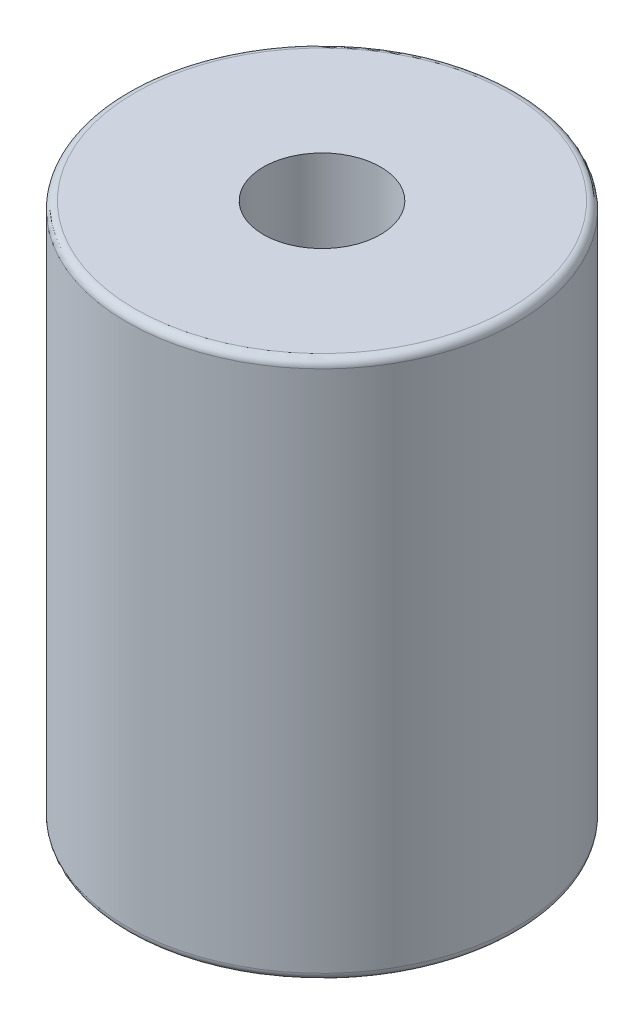
ISO-10303-21;
HEADER;
FILE_DESCRIPTION(('STEP AP214'),'2;1');
FILE_NAME('part.step','',(''),(''),'','','');
FILE_SCHEMA(('AUTOMOTIVE_DESIGN { 1 0 10303 214 1 1 1 1 }'));
ENDSEC;
DATA;
#1=APPLICATION_CONTEXT('core data for automotive mechanical design processes');
#2=APPLICATION_PROTOCOL_DEFINITION('international standard','automotive_design',2000,#1);
#3=PRODUCT_CONTEXT('',#1,'mechanical');
#4=PRODUCT('Part','Part','',(#3));
#5=PRODUCT_RELATED_PRODUCT_CATEGORY('part','',(#4));
#6=PRODUCT_DEFINITION_FORMATION('','',#4);
#7=PRODUCT_DEFINITION_CONTEXT('part definition',#1,'design');
#8=PRODUCT_DEFINITION('design','',#6,#7);
#9=PRODUCT_DEFINITION_SHAPE('','',#8);
#10=(LENGTH_UNIT() NAMED_UNIT(*) SI_UNIT(.MILLI.,.METRE.));
#11=(NAMED_UNIT(*) PLANE_ANGLE_UNIT() SI_UNIT($,.RADIAN.));
#12=(NAMED_UNIT(*) SI_UNIT($,.STERADIAN.) SOLID_ANGLE_UNIT());
#13=UNCERTAINTY_MEASURE_WITH_UNIT(LENGTH_MEASURE(1.E-05),#10,'distance_accuracy_value','');
#14=(GEOMETRIC_REPRESENTATION_CONTEXT(3) GLOBAL_UNCERTAINTY_ASSIGNED_CONTEXT((#13)) GLOBAL_UNIT_ASSIGNED_CONTEXT((#10,
#11,#12)) REPRESENTATION_CONTEXT('',''));
#15=CARTESIAN_POINT('',(0.,0.,0.));
#16=DIRECTION('',(0.,0.,1.));
#17=DIRECTION('',(1.,0.,0.));
#18=AXIS2_PLACEMENT_3D('',#15,#16,#17);
#19=CARTESIAN_POINT('',(0.,6.9,0.));
#20=DIRECTION('',(0.,-1.,0.));
#21=DIRECTION('',(0.,0.,-1.));
#22=AXIS2_PLACEMENT_3D('',#19,#20,#21);
#23=CYLINDRICAL_SURFACE('',#22,2.495);
#24=CARTESIAN_POINT('',(0.,0.1,0.));
#25=DIRECTION('',(0.,1.,0.));
#26=DIRECTION('',(0.,0.,1.));
#27=AXIS2_PLACEMENT_3D('',#24,#25,#26);
#28=CIRCLE('',#27,2.495);
#29=CARTESIAN_POINT('',(0.,0.1,2.495));
#30=VERTEX_POINT('',#29);
#31=EDGE_CURVE('E45',#30,#30,#28,.T.);
#32=ORIENTED_EDGE('',*,*,#31,.T.);
#33=EDGE_LOOP('',(#32));
#34=FACE_BOUND('',#33,.T.);
#35=CARTESIAN_POINT('',(0.,6.8,0.));
#36=DIRECTION('',(0.,1.,0.));
#37=DIRECTION('',(0.,0.,1.));
#38=AXIS2_PLACEMENT_3D('',#35,#36,#37);
#39=CIRCLE('',#38,2.495);
#40=CARTESIAN_POINT('',(0.,6.8,2.495));
#41=VERTEX_POINT('',#40);
#42=EDGE_CURVE('E49',#41,#41,#39,.F.);
#43=ORIENTED_EDGE('',*,*,#42,.T.);
#44=EDGE_LOOP('',(#43));
#45=FACE_BOUND('',#44,.T.);
#46=ADVANCED_FACE('F34',(#34,#45),#23,.T.);
#47=CARTESIAN_POINT('',(0.,6.9,0.));
#48=DIRECTION('',(0.,1.,0.));
#49=DIRECTION('',(0.,0.,1.));
#50=AXIS2_PLACEMENT_3D('',#47,#48,#49);
#51=PLANE('',#50);
#52=CARTESIAN_POINT('',(0.,6.9,0.));
#53=DIRECTION('',(0.,1.,0.));
#54=DIRECTION('',(0.,0.,1.));
#55=AXIS2_PLACEMENT_3D('',#52,#53,#54);
#56=CIRCLE('',#55,0.75);
#57=CARTESIAN_POINT('',(0.,6.9,0.75));
#58=VERTEX_POINT('',#57);
#59=EDGE_CURVE('E55',#58,#58,#56,.T.);
#60=ORIENTED_EDGE('',*,*,#59,.F.);
#61=EDGE_LOOP('',(#60));
#62=FACE_BOUND('',#61,.T.);
#63=CARTESIAN_POINT('',(0.,6.9,0.));
#64=DIRECTION('',(0.,1.,0.));
#65=DIRECTION('',(0.,0.,1.));
#66=AXIS2_PLACEMENT_3D('',#63,#64,#65);
#67=CIRCLE('',#66,2.395);
#68=CARTESIAN_POINT('',(0.,6.9,2.395));
#69=VERTEX_POINT('',#68);
#70=EDGE_CURVE('E10',#69,#69,#67,.T.);
#71=ORIENTED_EDGE('',*,*,#70,.T.);
#72=EDGE_LOOP('',(#71));
#73=FACE_BOUND('',#72,.T.);
#74=ADVANCED_FACE('F69',(#62,#73),#51,.T.);
#75=CARTESIAN_POINT('',(0.,0.,0.));
#76=DIRECTION('',(0.,1.,0.));
#77=DIRECTION('',(0.,0.,1.));
#78=AXIS2_PLACEMENT_3D('',#75,#76,#77);
#79=PLANE('',#78);
#80=CARTESIAN_POINT('',(0.,0.,0.));
#81=DIRECTION('',(0.,1.,0.));
#82=DIRECTION('',(0.,0.,1.));
#83=AXIS2_PLACEMENT_3D('',#80,#81,#82);
#84=CIRCLE('',#83,2.395);
#85=CARTESIAN_POINT('',(0.,0.,2.395));
#86=VERTEX_POINT('',#85);
#87=EDGE_CURVE('E41',#86,#86,#84,.F.);
#88=ORIENTED_EDGE('',*,*,#87,.T.);
#89=EDGE_LOOP('',(#88));
#90=FACE_BOUND('',#89,.T.);
#91=ADVANCED_FACE('F71',(#90),#79,.F.);
#92=CARTESIAN_POINT('',(0.,0.1,0.));
#93=DIRECTION('',(0.,1.,0.));
#94=DIRECTION('',(0.,0.,1.));
#95=AXIS2_PLACEMENT_3D('',#92,#93,#94);
#96=TOROIDAL_SURFACE('',#95,2.395,0.1);
#97=ORIENTED_EDGE('',*,*,#87,.F.);
#98=EDGE_LOOP('',(#97));
#99=FACE_BOUND('',#98,.T.);
#100=ORIENTED_EDGE('',*,*,#31,.F.);
#101=EDGE_LOOP('',(#100));
#102=FACE_BOUND('',#101,.T.);
#103=ADVANCED_FACE('F77',(#99,#102),#96,.T.);
#104=CARTESIAN_POINT('',(0.,6.8,0.));
#105=DIRECTION('',(0.,1.,0.));
#106=DIRECTION('',(0.,0.,1.));
#107=AXIS2_PLACEMENT_3D('',#104,#105,#106);
#108=TOROIDAL_SURFACE('',#107,2.395,0.1);
#109=ORIENTED_EDGE('',*,*,#42,.F.);
#110=EDGE_LOOP('',(#109));
#111=FACE_BOUND('',#110,.T.);
#112=ORIENTED_EDGE('',*,*,#70,.F.);
#113=EDGE_LOOP('',(#112));
#114=FACE_BOUND('',#113,.T.);
#115=ADVANCED_FACE('F36',(#111,#114),#108,.T.);
#116=CARTESIAN_POINT('',(0.,3.9,0.));
#117=DIRECTION('',(0.,1.,0.));
#118=DIRECTION('',(0.,0.,1.));
#119=AXIS2_PLACEMENT_3D('',#116,#117,#118);
#120=CYLINDRICAL_SURFACE('',#119,0.75);
#121=CARTESIAN_POINT('',(0.,3.9,0.));
#122=DIRECTION('',(0.,1.,0.));
#123=DIRECTION('',(0.,0.,1.));
#124=AXIS2_PLACEMENT_3D('',#121,#122,#123);
#125=CIRCLE('',#124,0.75);
#126=CARTESIAN_POINT('',(0.,3.9,0.75));
#127=VERTEX_POINT('',#126);
#128=EDGE_CURVE('E54',#127,#127,#125,.T.);
#129=ORIENTED_EDGE('',*,*,#128,.F.);
#130=EDGE_LOOP('',(#129));
#131=FACE_BOUND('',#130,.T.);
#132=ORIENTED_EDGE('',*,*,#59,.T.);
#133=EDGE_LOOP('',(#132));
#134=FACE_BOUND('',#133,.T.);
#135=ADVANCED_FACE('F63',(#131,#134),#120,.F.);
#136=CARTESIAN_POINT('',(0.,3.9,0.));
#137=DIRECTION('',(0.,1.,0.));
#138=DIRECTION('',(0.,0.,1.));
#139=AXIS2_PLACEMENT_3D('',#136,#137,#138);
#140=PLANE('',#139);
#141=ORIENTED_EDGE('',*,*,#128,.T.);
#142=EDGE_LOOP('',(#141));
#143=FACE_BOUND('',#142,.T.);
#144=ADVANCED_FACE('F61',(#143),#140,.T.);
#145=CLOSED_SHELL('',(#46,#74,#91,#103,#115,#135,#144));
#146=MANIFOLD_SOLID_BREP('B2',#145);
#147=ADVANCED_BREP_SHAPE_REPRESENTATION('',(#18,#146),#14);
#148=SHAPE_DEFINITION_REPRESENTATION(#9,#147);
ENDSEC;
END-ISO-10303-21;
